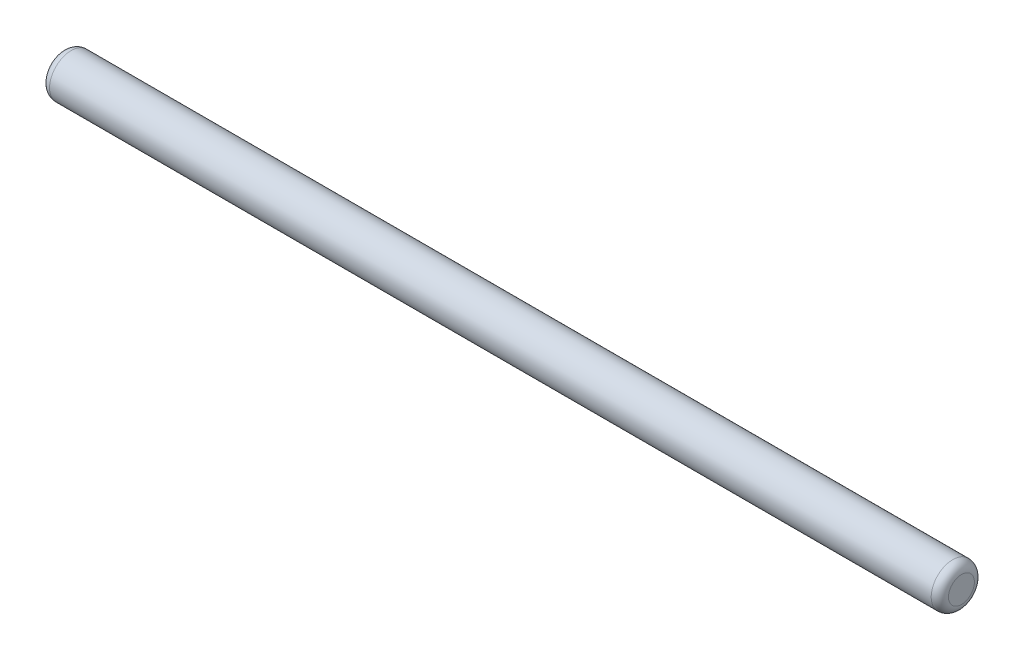
ISO-10303-21;
HEADER;
FILE_DESCRIPTION(('STEP AP214'),'2;1');
FILE_NAME('part.step','',(''),(''),'','','');
FILE_SCHEMA(('AUTOMOTIVE_DESIGN { 1 0 10303 214 1 1 1 1 }'));
ENDSEC;
DATA;
#1=APPLICATION_CONTEXT('core data for automotive mechanical design processes');
#2=APPLICATION_PROTOCOL_DEFINITION('international standard','automotive_design',2000,#1);
#3=PRODUCT_CONTEXT('',#1,'mechanical');
#4=PRODUCT('Part','Part','',(#3));
#5=PRODUCT_RELATED_PRODUCT_CATEGORY('part','',(#4));
#6=PRODUCT_DEFINITION_FORMATION('','',#4);
#7=PRODUCT_DEFINITION_CONTEXT('part definition',#1,'design');
#8=PRODUCT_DEFINITION('design','',#6,#7);
#9=PRODUCT_DEFINITION_SHAPE('','',#8);
#10=(LENGTH_UNIT() NAMED_UNIT(*) SI_UNIT(.MILLI.,.METRE.));
#11=(NAMED_UNIT(*) PLANE_ANGLE_UNIT() SI_UNIT($,.RADIAN.));
#12=(NAMED_UNIT(*) SI_UNIT($,.STERADIAN.) SOLID_ANGLE_UNIT());
#13=UNCERTAINTY_MEASURE_WITH_UNIT(LENGTH_MEASURE(1.E-05),#10,'distance_accuracy_value','');
#14=(GEOMETRIC_REPRESENTATION_CONTEXT(3) GLOBAL_UNCERTAINTY_ASSIGNED_CONTEXT((#13)) GLOBAL_UNIT_ASSIGNED_CONTEXT((#10,
#11,#12)) REPRESENTATION_CONTEXT('',''));
#15=CARTESIAN_POINT('',(0.,0.,0.));
#16=DIRECTION('',(0.,0.,1.));
#17=DIRECTION('',(1.,0.,0.));
#18=AXIS2_PLACEMENT_3D('',#15,#16,#17);
#19=CARTESIAN_POINT('',(104.,0.,0.));
#20=DIRECTION('',(-1.,0.,0.));
#21=DIRECTION('',(0.,0.,1.));
#22=AXIS2_PLACEMENT_3D('',#19,#20,#21);
#23=CYLINDRICAL_SURFACE('',#22,2.5);
#24=CARTESIAN_POINT('',(0.999999999999987,0.,0.));
#25=DIRECTION('',(1.,0.,0.));
#26=DIRECTION('',(0.,0.,-1.));
#27=AXIS2_PLACEMENT_3D('',#24,#25,#26);
#28=CIRCLE('',#27,2.5);
#29=CARTESIAN_POINT('',(0.999999999999987,0.,-2.5));
#30=VERTEX_POINT('',#29);
#31=EDGE_CURVE('E50',#30,#30,#28,.T.);
#32=ORIENTED_EDGE('',*,*,#31,.T.);
#33=EDGE_LOOP('',(#32));
#34=FACE_BOUND('',#33,.T.);
#35=CARTESIAN_POINT('',(103.,0.,0.));
#36=DIRECTION('',(1.,0.,0.));
#37=DIRECTION('',(0.,0.,-1.));
#38=AXIS2_PLACEMENT_3D('',#35,#36,#37);
#39=CIRCLE('',#38,2.5);
#40=CARTESIAN_POINT('',(103.,0.,-2.5));
#41=VERTEX_POINT('',#40);
#42=EDGE_CURVE('E54',#41,#41,#39,.F.);
#43=ORIENTED_EDGE('',*,*,#42,.T.);
#44=EDGE_LOOP('',(#43));
#45=FACE_BOUND('',#44,.T.);
#46=ADVANCED_FACE('F39',(#34,#45),#23,.T.);
#47=CARTESIAN_POINT('',(104.,0.,0.));
#48=DIRECTION('',(1.,0.,0.));
#49=DIRECTION('',(0.,0.,-1.));
#50=AXIS2_PLACEMENT_3D('',#47,#48,#49);
#51=PLANE('',#50);
#52=CARTESIAN_POINT('',(104.,0.,0.));
#53=DIRECTION('',(1.,0.,0.));
#54=DIRECTION('',(0.,0.,-1.));
#55=AXIS2_PLACEMENT_3D('',#52,#53,#54);
#56=CIRCLE('',#55,1.5);
#57=CARTESIAN_POINT('',(104.,0.,-1.5));
#58=VERTEX_POINT('',#57);
#59=EDGE_CURVE('E10',#58,#58,#56,.T.);
#60=ORIENTED_EDGE('',*,*,#59,.T.);
#61=EDGE_LOOP('',(#60));
#62=FACE_BOUND('',#61,.T.);
#63=ADVANCED_FACE('F70',(#62),#51,.T.);
#64=CARTESIAN_POINT('',(0.,0.,0.));
#65=DIRECTION('',(1.,0.,0.));
#66=DIRECTION('',(0.,0.,-1.));
#67=AXIS2_PLACEMENT_3D('',#64,#65,#66);
#68=PLANE('',#67);
#69=CARTESIAN_POINT('',(0.,0.,0.));
#70=DIRECTION('',(1.,0.,0.));
#71=DIRECTION('',(0.,0.,-1.));
#72=AXIS2_PLACEMENT_3D('',#69,#70,#71);
#73=CIRCLE('',#72,1.5);
#74=CARTESIAN_POINT('',(0.,0.,-1.5));
#75=VERTEX_POINT('',#74);
#76=EDGE_CURVE('E46',#75,#75,#73,.F.);
#77=ORIENTED_EDGE('',*,*,#76,.T.);
#78=EDGE_LOOP('',(#77));
#79=FACE_BOUND('',#78,.T.);
#80=ADVANCED_FACE('F67',(#79),#68,.F.);
#81=CARTESIAN_POINT('',(1.,0.,0.));
#82=DIRECTION('',(1.,0.,0.));
#83=DIRECTION('',(0.,0.,-1.));
#84=AXIS2_PLACEMENT_3D('',#81,#82,#83);
#85=TOROIDAL_SURFACE('',#84,1.5,1.);
#86=ORIENTED_EDGE('',*,*,#76,.F.);
#87=EDGE_LOOP('',(#86));
#88=FACE_BOUND('',#87,.T.);
#89=ORIENTED_EDGE('',*,*,#31,.F.);
#90=EDGE_LOOP('',(#89));
#91=FACE_BOUND('',#90,.T.);
#92=ADVANCED_FACE('F63',(#88,#91),#85,.T.);
#93=CARTESIAN_POINT('',(103.,0.,0.));
#94=DIRECTION('',(1.,0.,0.));
#95=DIRECTION('',(0.,0.,-1.));
#96=AXIS2_PLACEMENT_3D('',#93,#94,#95);
#97=TOROIDAL_SURFACE('',#96,1.5,1.);
#98=ORIENTED_EDGE('',*,*,#42,.F.);
#99=EDGE_LOOP('',(#98));
#100=FACE_BOUND('',#99,.T.);
#101=ORIENTED_EDGE('',*,*,#59,.F.);
#102=EDGE_LOOP('',(#101));
#103=FACE_BOUND('',#102,.T.);
#104=ADVANCED_FACE('F41',(#100,#103),#97,.T.);
#105=CLOSED_SHELL('',(#46,#63,#80,#92,#104));
#106=MANIFOLD_SOLID_BREP('B2',#105);
#107=ADVANCED_BREP_SHAPE_REPRESENTATION('',(#18,#106),#14);
#108=SHAPE_DEFINITION_REPRESENTATION(#9,#107);
ENDSEC;
END-ISO-10303-21;
